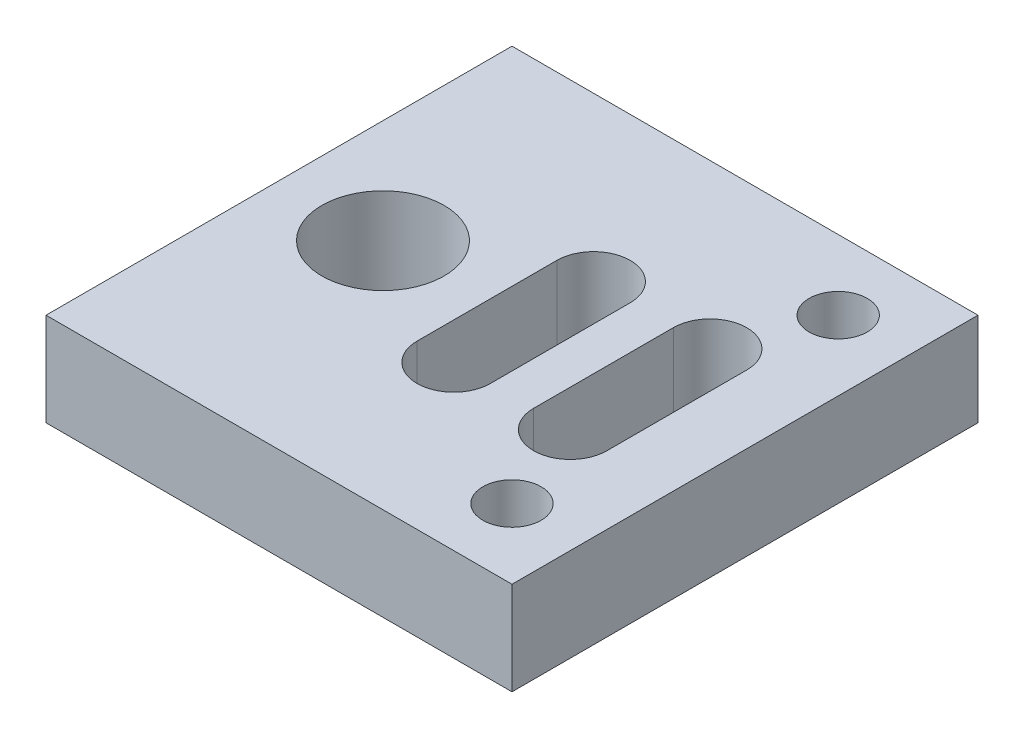
ISO-10303-21;
HEADER;
FILE_DESCRIPTION(('STEP AP214'),'2;1');
FILE_NAME('part.step','',(''),(''),'','','');
FILE_SCHEMA(('AUTOMOTIVE_DESIGN { 1 0 10303 214 1 1 1 1 }'));
ENDSEC;
DATA;
#1=APPLICATION_CONTEXT('core data for automotive mechanical design processes');
#2=APPLICATION_PROTOCOL_DEFINITION('international standard','automotive_design',2000,#1);
#3=PRODUCT_CONTEXT('',#1,'mechanical');
#4=PRODUCT('Part','Part','',(#3));
#5=PRODUCT_RELATED_PRODUCT_CATEGORY('part','',(#4));
#6=PRODUCT_DEFINITION_FORMATION('','',#4);
#7=PRODUCT_DEFINITION_CONTEXT('part definition',#1,'design');
#8=PRODUCT_DEFINITION('design','',#6,#7);
#9=PRODUCT_DEFINITION_SHAPE('','',#8);
#10=(LENGTH_UNIT() NAMED_UNIT(*) SI_UNIT(.MILLI.,.METRE.));
#11=(NAMED_UNIT(*) PLANE_ANGLE_UNIT() SI_UNIT($,.RADIAN.));
#12=(NAMED_UNIT(*) SI_UNIT($,.STERADIAN.) SOLID_ANGLE_UNIT());
#13=UNCERTAINTY_MEASURE_WITH_UNIT(LENGTH_MEASURE(1.E-05),#10,'distance_accuracy_value','');
#14=(GEOMETRIC_REPRESENTATION_CONTEXT(3) GLOBAL_UNCERTAINTY_ASSIGNED_CONTEXT((#13)) GLOBAL_UNIT_ASSIGNED_CONTEXT((#10,
#11,#12)) REPRESENTATION_CONTEXT('',''));
#15=CARTESIAN_POINT('',(0.,0.,0.));
#16=DIRECTION('',(0.,0.,1.));
#17=DIRECTION('',(1.,0.,0.));
#18=AXIS2_PLACEMENT_3D('',#15,#16,#17);
#19=CARTESIAN_POINT('',(0.,-4.,0.));
#20=DIRECTION('',(0.,0.,1.));
#21=DIRECTION('',(1.,0.,0.));
#22=AXIS2_PLACEMENT_3D('',#19,#20,#21);
#23=PLANE('',#22);
#24=DIRECTION('',(1.,0.,0.));
#25=VECTOR('',#24,1.);
#26=CARTESIAN_POINT('',(0.,0.,0.));
#27=LINE('',#26,#25);
#28=CARTESIAN_POINT('',(0.,0.,0.));
#29=VERTEX_POINT('',#28);
#30=CARTESIAN_POINT('',(20.,0.,0.));
#31=VERTEX_POINT('',#30);
#32=EDGE_CURVE('E203',#29,#31,#27,.T.);
#33=ORIENTED_EDGE('',*,*,#32,.F.);
#34=DIRECTION('',(0.,1.,0.));
#35=VECTOR('',#34,1.);
#36=CARTESIAN_POINT('',(0.,-4.,0.));
#37=LINE('',#36,#35);
#38=CARTESIAN_POINT('',(0.,-4.,0.));
#39=VERTEX_POINT('',#38);
#40=EDGE_CURVE('E11',#39,#29,#37,.T.);
#41=ORIENTED_EDGE('',*,*,#40,.F.);
#42=DIRECTION('',(1.,0.,0.));
#43=VECTOR('',#42,1.);
#44=CARTESIAN_POINT('',(0.,-4.,0.));
#45=LINE('',#44,#43);
#46=CARTESIAN_POINT('',(20.,-4.,0.));
#47=VERTEX_POINT('',#46);
#48=EDGE_CURVE('E206',#39,#47,#45,.T.);
#49=ORIENTED_EDGE('',*,*,#48,.T.);
#50=DIRECTION('',(0.,1.,0.));
#51=VECTOR('',#50,1.);
#52=CARTESIAN_POINT('',(20.,-4.,0.));
#53=LINE('',#52,#51);
#54=EDGE_CURVE('E35',#47,#31,#53,.T.);
#55=ORIENTED_EDGE('',*,*,#54,.T.);
#56=EDGE_LOOP('',(#33,#41,#49,#55));
#57=FACE_BOUND('',#56,.T.);
#58=ADVANCED_FACE('F32',(#57),#23,.T.);
#59=CARTESIAN_POINT('',(0.,-4.,-20.));
#60=DIRECTION('',(-1.,0.,0.));
#61=DIRECTION('',(0.,0.,1.));
#62=AXIS2_PLACEMENT_3D('',#59,#60,#61);
#63=PLANE('',#62);
#64=DIRECTION('',(0.,0.,1.));
#65=VECTOR('',#64,1.);
#66=CARTESIAN_POINT('',(0.,0.,-20.));
#67=LINE('',#66,#65);
#68=CARTESIAN_POINT('',(0.,0.,-20.));
#69=VERTEX_POINT('',#68);
#70=EDGE_CURVE('E210',#69,#29,#67,.T.);
#71=ORIENTED_EDGE('',*,*,#70,.F.);
#72=DIRECTION('',(0.,1.,0.));
#73=VECTOR('',#72,1.);
#74=CARTESIAN_POINT('',(0.,-4.,-20.));
#75=LINE('',#74,#73);
#76=CARTESIAN_POINT('',(0.,-4.,-20.));
#77=VERTEX_POINT('',#76);
#78=EDGE_CURVE('E40',#77,#69,#75,.T.);
#79=ORIENTED_EDGE('',*,*,#78,.F.);
#80=DIRECTION('',(0.,0.,1.));
#81=VECTOR('',#80,1.);
#82=CARTESIAN_POINT('',(0.,-4.,-20.));
#83=LINE('',#82,#81);
#84=EDGE_CURVE('E216',#77,#39,#83,.T.);
#85=ORIENTED_EDGE('',*,*,#84,.T.);
#86=ORIENTED_EDGE('',*,*,#40,.T.);
#87=EDGE_LOOP('',(#71,#79,#85,#86));
#88=FACE_BOUND('',#87,.T.);
#89=ADVANCED_FACE('F242',(#88),#63,.T.);
#90=CARTESIAN_POINT('',(20.,-4.,-20.));
#91=DIRECTION('',(0.,0.,-1.));
#92=DIRECTION('',(-1.,0.,0.));
#93=AXIS2_PLACEMENT_3D('',#90,#91,#92);
#94=PLANE('',#93);
#95=DIRECTION('',(-1.,0.,0.));
#96=VECTOR('',#95,1.);
#97=CARTESIAN_POINT('',(20.,0.,-20.));
#98=LINE('',#97,#96);
#99=CARTESIAN_POINT('',(20.,0.,-20.));
#100=VERTEX_POINT('',#99);
#101=EDGE_CURVE('E224',#100,#69,#98,.T.);
#102=ORIENTED_EDGE('',*,*,#101,.F.);
#103=DIRECTION('',(0.,1.,0.));
#104=VECTOR('',#103,1.);
#105=CARTESIAN_POINT('',(20.,-4.,-20.));
#106=LINE('',#105,#104);
#107=CARTESIAN_POINT('',(20.,-4.,-20.));
#108=VERTEX_POINT('',#107);
#109=EDGE_CURVE('E229',#108,#100,#106,.T.);
#110=ORIENTED_EDGE('',*,*,#109,.F.);
#111=DIRECTION('',(-1.,0.,0.));
#112=VECTOR('',#111,1.);
#113=CARTESIAN_POINT('',(20.,-4.,-20.));
#114=LINE('',#113,#112);
#115=EDGE_CURVE('E213',#108,#77,#114,.T.);
#116=ORIENTED_EDGE('',*,*,#115,.T.);
#117=ORIENTED_EDGE('',*,*,#78,.T.);
#118=EDGE_LOOP('',(#102,#110,#116,#117));
#119=FACE_BOUND('',#118,.T.);
#120=ADVANCED_FACE('F247',(#119),#94,.T.);
#121=CARTESIAN_POINT('',(20.,-4.,0.));
#122=DIRECTION('',(1.,0.,0.));
#123=DIRECTION('',(0.,0.,-1.));
#124=AXIS2_PLACEMENT_3D('',#121,#122,#123);
#125=PLANE('',#124);
#126=DIRECTION('',(0.,0.,-1.));
#127=VECTOR('',#126,1.);
#128=CARTESIAN_POINT('',(20.,0.,0.));
#129=LINE('',#128,#127);
#130=EDGE_CURVE('E221',#31,#100,#129,.T.);
#131=ORIENTED_EDGE('',*,*,#130,.F.);
#132=ORIENTED_EDGE('',*,*,#54,.F.);
#133=DIRECTION('',(0.,0.,-1.));
#134=VECTOR('',#133,1.);
#135=CARTESIAN_POINT('',(20.,-4.,0.));
#136=LINE('',#135,#134);
#137=EDGE_CURVE('E209',#47,#108,#136,.T.);
#138=ORIENTED_EDGE('',*,*,#137,.T.);
#139=ORIENTED_EDGE('',*,*,#109,.T.);
#140=EDGE_LOOP('',(#131,#132,#138,#139));
#141=FACE_BOUND('',#140,.T.);
#142=ADVANCED_FACE('F237',(#141),#125,.T.);
#143=CARTESIAN_POINT('',(0.,-4.,0.));
#144=DIRECTION('',(0.,1.,0.));
#145=DIRECTION('',(0.,0.,1.));
#146=AXIS2_PLACEMENT_3D('',#143,#144,#145);
#147=PLANE('',#146);
#148=CARTESIAN_POINT('',(17.,-4.,-3.));
#149=DIRECTION('',(0.,1.,0.));
#150=DIRECTION('',(0.,0.,-1.));
#151=AXIS2_PLACEMENT_3D('',#148,#149,#150);
#152=CIRCLE('',#151,1.25);
#153=CARTESIAN_POINT('',(17.,-4.,-4.25));
#154=VERTEX_POINT('',#153);
#155=EDGE_CURVE('E152',#154,#154,#152,.T.);
#156=ORIENTED_EDGE('',*,*,#155,.T.);
#157=EDGE_LOOP('',(#156));
#158=FACE_BOUND('',#157,.T.);
#159=DIRECTION('',(0.,0.,1.));
#160=VECTOR('',#159,1.);
#161=CARTESIAN_POINT('',(8.92500000000001,-4.,-7.));
#162=LINE('',#161,#160);
#163=CARTESIAN_POINT('',(8.92500000000001,-4.,-13.));
#164=VERTEX_POINT('',#163);
#165=CARTESIAN_POINT('',(8.92500000000001,-4.,-7.));
#166=VERTEX_POINT('',#165);
#167=EDGE_CURVE('E129',#164,#166,#162,.T.);
#168=ORIENTED_EDGE('',*,*,#167,.T.);
#169=CARTESIAN_POINT('',(10.5,-4.,-7.));
#170=DIRECTION('',(0.,1.,0.));
#171=DIRECTION('',(0.,0.,1.));
#172=AXIS2_PLACEMENT_3D('',#169,#170,#171);
#173=CIRCLE('',#172,1.575);
#174=CARTESIAN_POINT('',(12.075,-4.,-7.));
#175=VERTEX_POINT('',#174);
#176=EDGE_CURVE('E123',#166,#175,#173,.T.);
#177=ORIENTED_EDGE('',*,*,#176,.T.);
#178=DIRECTION('',(0.,0.,-1.));
#179=VECTOR('',#178,1.);
#180=CARTESIAN_POINT('',(12.075,-4.,-7.));
#181=LINE('',#180,#179);
#182=CARTESIAN_POINT('',(12.075,-4.,-13.));
#183=VERTEX_POINT('',#182);
#184=EDGE_CURVE('E132',#175,#183,#181,.T.);
#185=ORIENTED_EDGE('',*,*,#184,.T.);
#186=CARTESIAN_POINT('',(10.5,-4.,-13.));
#187=DIRECTION('',(0.,1.,0.));
#188=DIRECTION('',(0.,0.,1.));
#189=AXIS2_PLACEMENT_3D('',#186,#187,#188);
#190=CIRCLE('',#189,1.575);
#191=EDGE_CURVE('E48',#183,#164,#190,.T.);
#192=ORIENTED_EDGE('',*,*,#191,.T.);
#193=EDGE_LOOP('',(#168,#177,#185,#192));
#194=FACE_BOUND('',#193,.T.);
#195=CARTESIAN_POINT('',(4.4625,-4.,-10.));
#196=DIRECTION('',(0.,1.,0.));
#197=DIRECTION('',(0.,0.,-1.));
#198=AXIS2_PLACEMENT_3D('',#195,#196,#197);
#199=CIRCLE('',#198,2.625);
#200=CARTESIAN_POINT('',(4.4625,-4.,-12.625));
#201=VERTEX_POINT('',#200);
#202=EDGE_CURVE('E162',#201,#201,#199,.T.);
#203=ORIENTED_EDGE('',*,*,#202,.T.);
#204=EDGE_LOOP('',(#203));
#205=FACE_BOUND('',#204,.T.);
#206=DIRECTION('',(0.,0.,1.));
#207=VECTOR('',#206,1.);
#208=CARTESIAN_POINT('',(13.925,-4.,-7.));
#209=LINE('',#208,#207);
#210=CARTESIAN_POINT('',(13.925,-4.,-13.));
#211=VERTEX_POINT('',#210);
#212=CARTESIAN_POINT('',(13.925,-4.,-7.));
#213=VERTEX_POINT('',#212);
#214=EDGE_CURVE('E178',#211,#213,#209,.T.);
#215=ORIENTED_EDGE('',*,*,#214,.T.);
#216=CARTESIAN_POINT('',(15.5,-4.,-7.));
#217=DIRECTION('',(0.,1.,0.));
#218=DIRECTION('',(0.,0.,1.));
#219=AXIS2_PLACEMENT_3D('',#216,#217,#218);
#220=CIRCLE('',#219,1.575);
#221=CARTESIAN_POINT('',(17.075,-4.,-7.));
#222=VERTEX_POINT('',#221);
#223=EDGE_CURVE('E168',#213,#222,#220,.T.);
#224=ORIENTED_EDGE('',*,*,#223,.T.);
#225=DIRECTION('',(0.,0.,-1.));
#226=VECTOR('',#225,1.);
#227=CARTESIAN_POINT('',(17.075,-4.,-7.));
#228=LINE('',#227,#226);
#229=CARTESIAN_POINT('',(17.075,-4.,-13.));
#230=VERTEX_POINT('',#229);
#231=EDGE_CURVE('E171',#222,#230,#228,.T.);
#232=ORIENTED_EDGE('',*,*,#231,.T.);
#233=CARTESIAN_POINT('',(15.5,-4.,-13.));
#234=DIRECTION('',(0.,1.,0.));
#235=DIRECTION('',(0.,0.,1.));
#236=AXIS2_PLACEMENT_3D('',#233,#234,#235);
#237=CIRCLE('',#236,1.575);
#238=EDGE_CURVE('E175',#230,#211,#237,.T.);
#239=ORIENTED_EDGE('',*,*,#238,.T.);
#240=EDGE_LOOP('',(#215,#224,#232,#239));
#241=FACE_BOUND('',#240,.T.);
#242=CARTESIAN_POINT('',(17.,-4.,-17.));
#243=DIRECTION('',(0.,1.,0.));
#244=DIRECTION('',(0.,0.,-1.));
#245=AXIS2_PLACEMENT_3D('',#242,#243,#244);
#246=CIRCLE('',#245,1.25);
#247=CARTESIAN_POINT('',(17.,-4.,-18.25));
#248=VERTEX_POINT('',#247);
#249=EDGE_CURVE('E200',#248,#248,#246,.T.);
#250=ORIENTED_EDGE('',*,*,#249,.T.);
#251=EDGE_LOOP('',(#250));
#252=FACE_BOUND('',#251,.T.);
#253=ORIENTED_EDGE('',*,*,#48,.F.);
#254=ORIENTED_EDGE('',*,*,#84,.F.);
#255=ORIENTED_EDGE('',*,*,#115,.F.);
#256=ORIENTED_EDGE('',*,*,#137,.F.);
#257=EDGE_LOOP('',(#253,#254,#255,#256));
#258=FACE_BOUND('',#257,.T.);
#259=ADVANCED_FACE('F136',(#158,#194,#205,#241,#252,#258),#147,.F.);
#260=CARTESIAN_POINT('',(0.,0.,0.));
#261=DIRECTION('',(0.,1.,0.));
#262=DIRECTION('',(0.,0.,1.));
#263=AXIS2_PLACEMENT_3D('',#260,#261,#262);
#264=PLANE('',#263);
#265=CARTESIAN_POINT('',(17.,0.,-3.));
#266=DIRECTION('',(0.,1.,0.));
#267=DIRECTION('',(0.,0.,-1.));
#268=AXIS2_PLACEMENT_3D('',#265,#266,#267);
#269=CIRCLE('',#268,1.25);
#270=CARTESIAN_POINT('',(17.,0.,-4.25));
#271=VERTEX_POINT('',#270);
#272=EDGE_CURVE('E145',#271,#271,#269,.T.);
#273=ORIENTED_EDGE('',*,*,#272,.F.);
#274=EDGE_LOOP('',(#273));
#275=FACE_BOUND('',#274,.T.);
#276=CARTESIAN_POINT('',(10.5,0.,-7.));
#277=DIRECTION('',(0.,1.,0.));
#278=DIRECTION('',(0.,0.,1.));
#279=AXIS2_PLACEMENT_3D('',#276,#277,#278);
#280=CIRCLE('',#279,1.575);
#281=CARTESIAN_POINT('',(8.92500000000001,0.,-7.));
#282=VERTEX_POINT('',#281);
#283=CARTESIAN_POINT('',(12.075,0.,-7.));
#284=VERTEX_POINT('',#283);
#285=EDGE_CURVE('E56',#282,#284,#280,.T.);
#286=ORIENTED_EDGE('',*,*,#285,.F.);
#287=DIRECTION('',(0.,0.,1.));
#288=VECTOR('',#287,1.);
#289=CARTESIAN_POINT('',(8.92500000000001,0.,-7.));
#290=LINE('',#289,#288);
#291=CARTESIAN_POINT('',(8.92500000000001,0.,-13.));
#292=VERTEX_POINT('',#291);
#293=EDGE_CURVE('E139',#292,#282,#290,.T.);
#294=ORIENTED_EDGE('',*,*,#293,.F.);
#295=CARTESIAN_POINT('',(10.5,0.,-13.));
#296=DIRECTION('',(0.,1.,0.));
#297=DIRECTION('',(0.,0.,1.));
#298=AXIS2_PLACEMENT_3D('',#295,#296,#297);
#299=CIRCLE('',#298,1.575);
#300=CARTESIAN_POINT('',(12.075,0.,-13.));
#301=VERTEX_POINT('',#300);
#302=EDGE_CURVE('E142',#301,#292,#299,.T.);
#303=ORIENTED_EDGE('',*,*,#302,.F.);
#304=DIRECTION('',(0.,0.,-1.));
#305=VECTOR('',#304,1.);
#306=CARTESIAN_POINT('',(12.075,0.,-7.));
#307=LINE('',#306,#305);
#308=EDGE_CURVE('E151',#284,#301,#307,.T.);
#309=ORIENTED_EDGE('',*,*,#308,.F.);
#310=EDGE_LOOP('',(#286,#294,#303,#309));
#311=FACE_BOUND('',#310,.T.);
#312=CARTESIAN_POINT('',(4.4625,0.,-10.));
#313=DIRECTION('',(0.,1.,0.));
#314=DIRECTION('',(0.,0.,-1.));
#315=AXIS2_PLACEMENT_3D('',#312,#313,#314);
#316=CIRCLE('',#315,2.625);
#317=CARTESIAN_POINT('',(4.4625,0.,-12.625));
#318=VERTEX_POINT('',#317);
#319=EDGE_CURVE('E158',#318,#318,#316,.T.);
#320=ORIENTED_EDGE('',*,*,#319,.F.);
#321=EDGE_LOOP('',(#320));
#322=FACE_BOUND('',#321,.T.);
#323=CARTESIAN_POINT('',(15.5,0.,-7.));
#324=DIRECTION('',(0.,1.,0.));
#325=DIRECTION('',(0.,0.,1.));
#326=AXIS2_PLACEMENT_3D('',#323,#324,#325);
#327=CIRCLE('',#326,1.575);
#328=CARTESIAN_POINT('',(13.925,0.,-7.));
#329=VERTEX_POINT('',#328);
#330=CARTESIAN_POINT('',(17.075,0.,-7.));
#331=VERTEX_POINT('',#330);
#332=EDGE_CURVE('E165',#329,#331,#327,.T.);
#333=ORIENTED_EDGE('',*,*,#332,.F.);
#334=DIRECTION('',(0.,0.,1.));
#335=VECTOR('',#334,1.);
#336=CARTESIAN_POINT('',(13.925,0.,-7.));
#337=LINE('',#336,#335);
#338=CARTESIAN_POINT('',(13.925,0.,-13.));
#339=VERTEX_POINT('',#338);
#340=EDGE_CURVE('E172',#339,#329,#337,.T.);
#341=ORIENTED_EDGE('',*,*,#340,.F.);
#342=CARTESIAN_POINT('',(15.5,0.,-13.));
#343=DIRECTION('',(0.,1.,0.));
#344=DIRECTION('',(0.,0.,1.));
#345=AXIS2_PLACEMENT_3D('',#342,#343,#344);
#346=CIRCLE('',#345,1.575);
#347=CARTESIAN_POINT('',(17.075,0.,-13.));
#348=VERTEX_POINT('',#347);
#349=EDGE_CURVE('E186',#348,#339,#346,.T.);
#350=ORIENTED_EDGE('',*,*,#349,.F.);
#351=DIRECTION('',(0.,0.,-1.));
#352=VECTOR('',#351,1.);
#353=CARTESIAN_POINT('',(17.075,0.,-7.));
#354=LINE('',#353,#352);
#355=EDGE_CURVE('E183',#331,#348,#354,.T.);
#356=ORIENTED_EDGE('',*,*,#355,.F.);
#357=EDGE_LOOP('',(#333,#341,#350,#356));
#358=FACE_BOUND('',#357,.T.);
#359=CARTESIAN_POINT('',(17.,0.,-17.));
#360=DIRECTION('',(0.,1.,0.));
#361=DIRECTION('',(0.,0.,-1.));
#362=AXIS2_PLACEMENT_3D('',#359,#360,#361);
#363=CIRCLE('',#362,1.25);
#364=CARTESIAN_POINT('',(17.,0.,-18.25));
#365=VERTEX_POINT('',#364);
#366=EDGE_CURVE('E193',#365,#365,#363,.T.);
#367=ORIENTED_EDGE('',*,*,#366,.F.);
#368=EDGE_LOOP('',(#367));
#369=FACE_BOUND('',#368,.T.);
#370=ORIENTED_EDGE('',*,*,#32,.T.);
#371=ORIENTED_EDGE('',*,*,#130,.T.);
#372=ORIENTED_EDGE('',*,*,#101,.T.);
#373=ORIENTED_EDGE('',*,*,#70,.T.);
#374=EDGE_LOOP('',(#370,#371,#372,#373));
#375=FACE_BOUND('',#374,.T.);
#376=ADVANCED_FACE('F239',(#275,#311,#322,#358,#369,#375),#264,.T.);
#377=CARTESIAN_POINT('',(17.,-4.,-17.));
#378=DIRECTION('',(0.,1.,0.));
#379=DIRECTION('',(0.,0.,1.));
#380=AXIS2_PLACEMENT_3D('',#377,#378,#379);
#381=CYLINDRICAL_SURFACE('',#380,1.25);
#382=ORIENTED_EDGE('',*,*,#249,.F.);
#383=EDGE_LOOP('',(#382));
#384=FACE_BOUND('',#383,.T.);
#385=ORIENTED_EDGE('',*,*,#366,.T.);
#386=EDGE_LOOP('',(#385));
#387=FACE_BOUND('',#386,.T.);
#388=ADVANCED_FACE('F290',(#384,#387),#381,.F.);
#389=CARTESIAN_POINT('',(15.5,-4.,-7.));
#390=DIRECTION('',(0.,1.,0.));
#391=DIRECTION('',(0.,0.,1.));
#392=AXIS2_PLACEMENT_3D('',#389,#390,#391);
#393=CYLINDRICAL_SURFACE('',#392,1.575);
#394=ORIENTED_EDGE('',*,*,#332,.T.);
#395=DIRECTION('',(0.,1.,0.));
#396=VECTOR('',#395,1.);
#397=CARTESIAN_POINT('',(17.075,-4.,-7.));
#398=LINE('',#397,#396);
#399=EDGE_CURVE('E181',#222,#331,#398,.T.);
#400=ORIENTED_EDGE('',*,*,#399,.F.);
#401=ORIENTED_EDGE('',*,*,#223,.F.);
#402=DIRECTION('',(0.,1.,0.));
#403=VECTOR('',#402,1.);
#404=CARTESIAN_POINT('',(13.925,-4.,-7.));
#405=LINE('',#404,#403);
#406=EDGE_CURVE('E191',#213,#329,#405,.T.);
#407=ORIENTED_EDGE('',*,*,#406,.T.);
#408=EDGE_LOOP('',(#394,#400,#401,#407));
#409=FACE_BOUND('',#408,.T.);
#410=ADVANCED_FACE('F300',(#409),#393,.F.);
#411=CARTESIAN_POINT('',(13.925,-4.,-7.));
#412=DIRECTION('',(-1.,0.,0.));
#413=DIRECTION('',(0.,0.,1.));
#414=AXIS2_PLACEMENT_3D('',#411,#412,#413);
#415=PLANE('',#414);
#416=ORIENTED_EDGE('',*,*,#340,.T.);
#417=ORIENTED_EDGE('',*,*,#406,.F.);
#418=ORIENTED_EDGE('',*,*,#214,.F.);
#419=DIRECTION('',(0.,1.,0.));
#420=VECTOR('',#419,1.);
#421=CARTESIAN_POINT('',(13.925,-4.,-13.));
#422=LINE('',#421,#420);
#423=EDGE_CURVE('E194',#211,#339,#422,.T.);
#424=ORIENTED_EDGE('',*,*,#423,.T.);
#425=EDGE_LOOP('',(#416,#417,#418,#424));
#426=FACE_BOUND('',#425,.T.);
#427=ADVANCED_FACE('F310',(#426),#415,.F.);
#428=CARTESIAN_POINT('',(15.5,-4.,-13.));
#429=DIRECTION('',(0.,1.,0.));
#430=DIRECTION('',(0.,0.,1.));
#431=AXIS2_PLACEMENT_3D('',#428,#429,#430);
#432=CYLINDRICAL_SURFACE('',#431,1.575);
#433=ORIENTED_EDGE('',*,*,#349,.T.);
#434=ORIENTED_EDGE('',*,*,#423,.F.);
#435=ORIENTED_EDGE('',*,*,#238,.F.);
#436=DIRECTION('',(0.,1.,0.));
#437=VECTOR('',#436,1.);
#438=CARTESIAN_POINT('',(17.075,-4.,-13.));
#439=LINE('',#438,#437);
#440=EDGE_CURVE('E196',#230,#348,#439,.T.);
#441=ORIENTED_EDGE('',*,*,#440,.T.);
#442=EDGE_LOOP('',(#433,#434,#435,#441));
#443=FACE_BOUND('',#442,.T.);
#444=ADVANCED_FACE('F320',(#443),#432,.F.);
#445=CARTESIAN_POINT('',(17.075,-4.,-7.));
#446=DIRECTION('',(1.,0.,0.));
#447=DIRECTION('',(0.,0.,-1.));
#448=AXIS2_PLACEMENT_3D('',#445,#446,#447);
#449=PLANE('',#448);
#450=ORIENTED_EDGE('',*,*,#355,.T.);
#451=ORIENTED_EDGE('',*,*,#440,.F.);
#452=ORIENTED_EDGE('',*,*,#231,.F.);
#453=ORIENTED_EDGE('',*,*,#399,.T.);
#454=EDGE_LOOP('',(#450,#451,#452,#453));
#455=FACE_BOUND('',#454,.T.);
#456=ADVANCED_FACE('F330',(#455),#449,.F.);
#457=CARTESIAN_POINT('',(4.4625,-4.,-10.));
#458=DIRECTION('',(0.,1.,0.));
#459=DIRECTION('',(0.,0.,1.));
#460=AXIS2_PLACEMENT_3D('',#457,#458,#459);
#461=CYLINDRICAL_SURFACE('',#460,2.625);
#462=ORIENTED_EDGE('',*,*,#202,.F.);
#463=EDGE_LOOP('',(#462));
#464=FACE_BOUND('',#463,.T.);
#465=ORIENTED_EDGE('',*,*,#319,.T.);
#466=EDGE_LOOP('',(#465));
#467=FACE_BOUND('',#466,.T.);
#468=ADVANCED_FACE('F340',(#464,#467),#461,.F.);
#469=CARTESIAN_POINT('',(10.5,-4.,-7.));
#470=DIRECTION('',(0.,1.,0.));
#471=DIRECTION('',(0.,0.,1.));
#472=AXIS2_PLACEMENT_3D('',#469,#470,#471);
#473=CYLINDRICAL_SURFACE('',#472,1.575);
#474=ORIENTED_EDGE('',*,*,#285,.T.);
#475=DIRECTION('',(0.,1.,0.));
#476=VECTOR('',#475,1.);
#477=CARTESIAN_POINT('',(12.075,-4.,-7.));
#478=LINE('',#477,#476);
#479=EDGE_CURVE('E119',#175,#284,#478,.T.);
#480=ORIENTED_EDGE('',*,*,#479,.F.);
#481=ORIENTED_EDGE('',*,*,#176,.F.);
#482=DIRECTION('',(0.,1.,0.));
#483=VECTOR('',#482,1.);
#484=CARTESIAN_POINT('',(8.92500000000001,-4.,-7.));
#485=LINE('',#484,#483);
#486=EDGE_CURVE('E156',#166,#282,#485,.T.);
#487=ORIENTED_EDGE('',*,*,#486,.T.);
#488=EDGE_LOOP('',(#474,#480,#481,#487));
#489=FACE_BOUND('',#488,.T.);
#490=ADVANCED_FACE('F121',(#489),#473,.F.);
#491=CARTESIAN_POINT('',(8.92500000000001,-4.,-7.));
#492=DIRECTION('',(-1.,0.,0.));
#493=DIRECTION('',(0.,0.,1.));
#494=AXIS2_PLACEMENT_3D('',#491,#492,#493);
#495=PLANE('',#494);
#496=ORIENTED_EDGE('',*,*,#293,.T.);
#497=ORIENTED_EDGE('',*,*,#486,.F.);
#498=ORIENTED_EDGE('',*,*,#167,.F.);
#499=DIRECTION('',(0.,1.,0.));
#500=VECTOR('',#499,1.);
#501=CARTESIAN_POINT('',(8.92500000000001,-4.,-13.));
#502=LINE('',#501,#500);
#503=EDGE_CURVE('E159',#164,#292,#502,.T.);
#504=ORIENTED_EDGE('',*,*,#503,.T.);
#505=EDGE_LOOP('',(#496,#497,#498,#504));
#506=FACE_BOUND('',#505,.T.);
#507=ADVANCED_FACE('F359',(#506),#495,.F.);
#508=CARTESIAN_POINT('',(10.5,-4.,-13.));
#509=DIRECTION('',(0.,1.,0.));
#510=DIRECTION('',(0.,0.,1.));
#511=AXIS2_PLACEMENT_3D('',#508,#509,#510);
#512=CYLINDRICAL_SURFACE('',#511,1.575);
#513=ORIENTED_EDGE('',*,*,#302,.T.);
#514=ORIENTED_EDGE('',*,*,#503,.F.);
#515=ORIENTED_EDGE('',*,*,#191,.F.);
#516=DIRECTION('',(0.,1.,0.));
#517=VECTOR('',#516,1.);
#518=CARTESIAN_POINT('',(12.075,-4.,-13.));
#519=LINE('',#518,#517);
#520=EDGE_CURVE('E128',#183,#301,#519,.T.);
#521=ORIENTED_EDGE('',*,*,#520,.T.);
#522=EDGE_LOOP('',(#513,#514,#515,#521));
#523=FACE_BOUND('',#522,.T.);
#524=ADVANCED_FACE('F368',(#523),#512,.F.);
#525=CARTESIAN_POINT('',(12.075,-4.,-7.));
#526=DIRECTION('',(1.,0.,0.));
#527=DIRECTION('',(0.,0.,-1.));
#528=AXIS2_PLACEMENT_3D('',#525,#526,#527);
#529=PLANE('',#528);
#530=ORIENTED_EDGE('',*,*,#308,.T.);
#531=ORIENTED_EDGE('',*,*,#520,.F.);
#532=ORIENTED_EDGE('',*,*,#184,.F.);
#533=ORIENTED_EDGE('',*,*,#479,.T.);
#534=EDGE_LOOP('',(#530,#531,#532,#533));
#535=FACE_BOUND('',#534,.T.);
#536=ADVANCED_FACE('F133',(#535),#529,.F.);
#537=CARTESIAN_POINT('',(17.,-4.,-3.));
#538=DIRECTION('',(0.,1.,0.));
#539=DIRECTION('',(0.,0.,1.));
#540=AXIS2_PLACEMENT_3D('',#537,#538,#539);
#541=CYLINDRICAL_SURFACE('',#540,1.25);
#542=ORIENTED_EDGE('',*,*,#155,.F.);
#543=EDGE_LOOP('',(#542));
#544=FACE_BOUND('',#543,.T.);
#545=ORIENTED_EDGE('',*,*,#272,.T.);
#546=EDGE_LOOP('',(#545));
#547=FACE_BOUND('',#546,.T.);
#548=ADVANCED_FACE('F386',(#544,#547),#541,.F.);
#549=CLOSED_SHELL('',(#58,#89,#120,#142,#259,#376,#388,#410,#427,#444,#456,#468,#490,#507,#524,
#536,#548));
#550=MANIFOLD_SOLID_BREP('B2',#549);
#551=ADVANCED_BREP_SHAPE_REPRESENTATION('',(#18,#550),#14);
#552=SHAPE_DEFINITION_REPRESENTATION(#9,#551);
ENDSEC;
END-ISO-10303-21;
